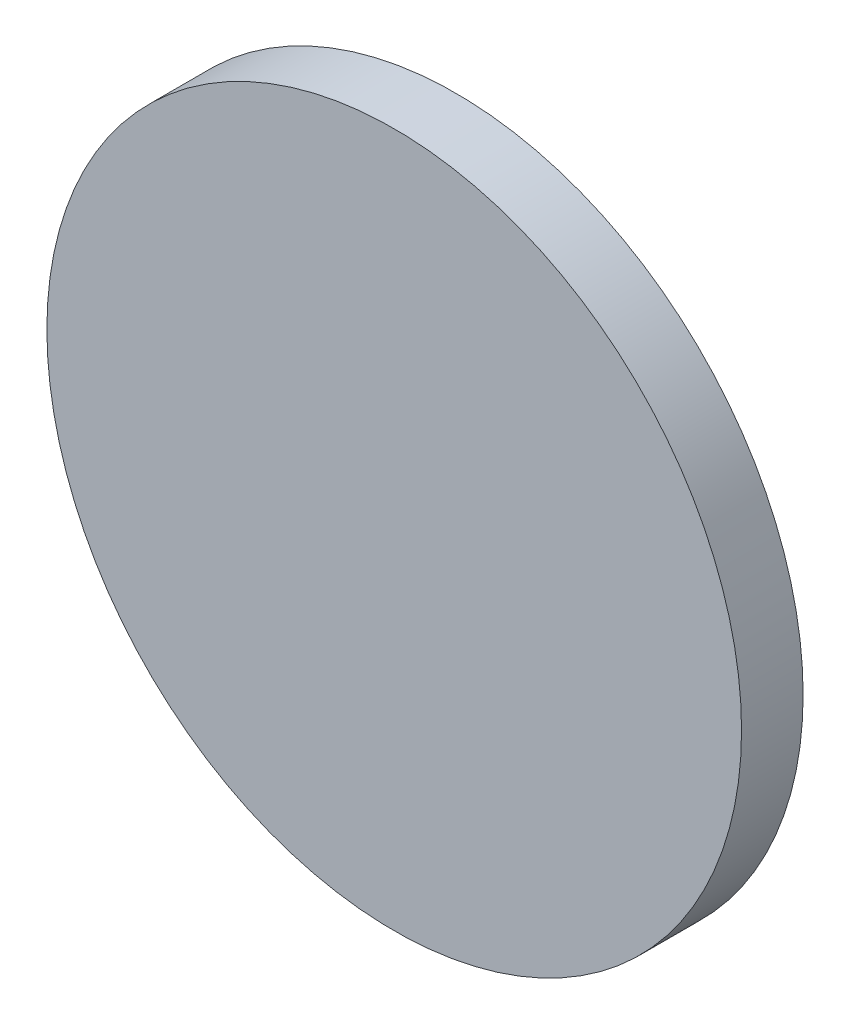
ISO-10303-21;
HEADER;
FILE_DESCRIPTION(('STEP AP214'),'2;1');
FILE_NAME('part.step','',(''),(''),'','','');
FILE_SCHEMA(('AUTOMOTIVE_DESIGN { 1 0 10303 214 1 1 1 1 }'));
ENDSEC;
DATA;
#1=APPLICATION_CONTEXT('core data for automotive mechanical design processes');
#2=APPLICATION_PROTOCOL_DEFINITION('international standard','automotive_design',2000,#1);
#3=PRODUCT_CONTEXT('',#1,'mechanical');
#4=PRODUCT('Part','Part','',(#3));
#5=PRODUCT_RELATED_PRODUCT_CATEGORY('part','',(#4));
#6=PRODUCT_DEFINITION_FORMATION('','',#4);
#7=PRODUCT_DEFINITION_CONTEXT('part definition',#1,'design');
#8=PRODUCT_DEFINITION('design','',#6,#7);
#9=PRODUCT_DEFINITION_SHAPE('','',#8);
#10=(LENGTH_UNIT() NAMED_UNIT(*) SI_UNIT(.MILLI.,.METRE.));
#11=(NAMED_UNIT(*) PLANE_ANGLE_UNIT() SI_UNIT($,.RADIAN.));
#12=(NAMED_UNIT(*) SI_UNIT($,.STERADIAN.) SOLID_ANGLE_UNIT());
#13=UNCERTAINTY_MEASURE_WITH_UNIT(LENGTH_MEASURE(1.E-05),#10,'distance_accuracy_value','');
#14=(GEOMETRIC_REPRESENTATION_CONTEXT(3) GLOBAL_UNCERTAINTY_ASSIGNED_CONTEXT((#13)) GLOBAL_UNIT_ASSIGNED_CONTEXT((#10,
#11,#12)) REPRESENTATION_CONTEXT('',''));
#15=CARTESIAN_POINT('',(0.,0.,0.));
#16=DIRECTION('',(0.,0.,1.));
#17=DIRECTION('',(1.,0.,0.));
#18=AXIS2_PLACEMENT_3D('',#15,#16,#17);
#19=CARTESIAN_POINT('',(0.,0.,2.54));
#20=DIRECTION('',(0.,0.,-1.));
#21=DIRECTION('',(-1.,0.,0.));
#22=AXIS2_PLACEMENT_3D('',#19,#20,#21);
#23=CYLINDRICAL_SURFACE('',#22,14.3273388220417);
#24=CARTESIAN_POINT('',(0.,0.,2.54));
#25=DIRECTION('',(0.,0.,1.));
#26=DIRECTION('',(1.,0.,0.));
#27=AXIS2_PLACEMENT_3D('',#24,#25,#26);
#28=CIRCLE('',#27,14.3273388220417);
#29=CARTESIAN_POINT('',(14.3273388220417,0.,2.54));
#30=VERTEX_POINT('',#29);
#31=EDGE_CURVE('E10',#30,#30,#28,.T.);
#32=ORIENTED_EDGE('',*,*,#31,.F.);
#33=EDGE_LOOP('',(#32));
#34=FACE_BOUND('',#33,.T.);
#35=CARTESIAN_POINT('',(0.,0.,0.));
#36=DIRECTION('',(0.,0.,1.));
#37=DIRECTION('',(1.,0.,0.));
#38=AXIS2_PLACEMENT_3D('',#35,#36,#37);
#39=CIRCLE('',#38,14.3273388220417);
#40=CARTESIAN_POINT('',(14.3273388220417,0.,0.));
#41=VERTEX_POINT('',#40);
#42=EDGE_CURVE('E36',#41,#41,#39,.T.);
#43=ORIENTED_EDGE('',*,*,#42,.T.);
#44=EDGE_LOOP('',(#43));
#45=FACE_BOUND('',#44,.T.);
#46=ADVANCED_FACE('F33',(#34,#45),#23,.T.);
#47=CARTESIAN_POINT('',(0.,0.,2.54));
#48=DIRECTION('',(0.,0.,1.));
#49=DIRECTION('',(1.,0.,0.));
#50=AXIS2_PLACEMENT_3D('',#47,#48,#49);
#51=PLANE('',#50);
#52=ORIENTED_EDGE('',*,*,#31,.T.);
#53=EDGE_LOOP('',(#52));
#54=FACE_BOUND('',#53,.T.);
#55=ADVANCED_FACE('F48',(#54),#51,.T.);
#56=CARTESIAN_POINT('',(0.,0.,0.));
#57=DIRECTION('',(0.,0.,1.));
#58=DIRECTION('',(1.,0.,0.));
#59=AXIS2_PLACEMENT_3D('',#56,#57,#58);
#60=PLANE('',#59);
#61=ORIENTED_EDGE('',*,*,#42,.F.);
#62=EDGE_LOOP('',(#61));
#63=FACE_BOUND('',#62,.T.);
#64=ADVANCED_FACE('F46',(#63),#60,.F.);
#65=CLOSED_SHELL('',(#46,#55,#64));
#66=MANIFOLD_SOLID_BREP('B2',#65);
#67=ADVANCED_BREP_SHAPE_REPRESENTATION('',(#18,#66),#14);
#68=SHAPE_DEFINITION_REPRESENTATION(#9,#67);
ENDSEC;
END-ISO-10303-21;
